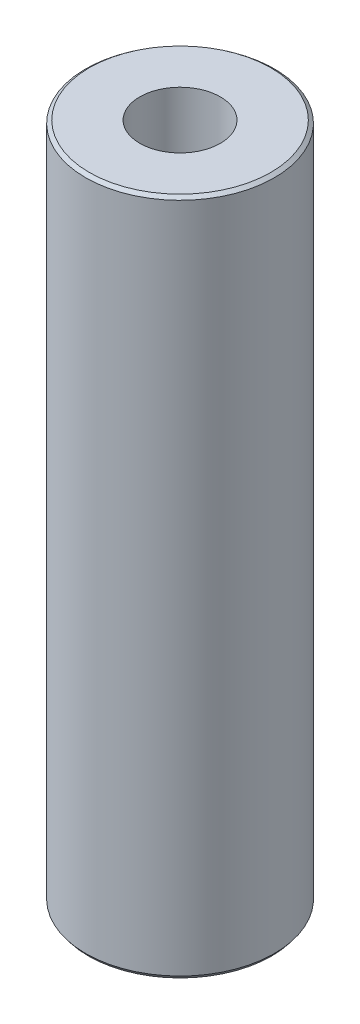
ISO-10303-21;
HEADER;
FILE_DESCRIPTION(('STEP AP214'),'2;1');
FILE_NAME('part.step','',(''),(''),'','','');
FILE_SCHEMA(('AUTOMOTIVE_DESIGN { 1 0 10303 214 1 1 1 1 }'));
ENDSEC;
DATA;
#1=APPLICATION_CONTEXT('core data for automotive mechanical design processes');
#2=APPLICATION_PROTOCOL_DEFINITION('international standard','automotive_design',2000,#1);
#3=PRODUCT_CONTEXT('',#1,'mechanical');
#4=PRODUCT('Part','Part','',(#3));
#5=PRODUCT_RELATED_PRODUCT_CATEGORY('part','',(#4));
#6=PRODUCT_DEFINITION_FORMATION('','',#4);
#7=PRODUCT_DEFINITION_CONTEXT('part definition',#1,'design');
#8=PRODUCT_DEFINITION('design','',#6,#7);
#9=PRODUCT_DEFINITION_SHAPE('','',#8);
#10=(LENGTH_UNIT() NAMED_UNIT(*) SI_UNIT(.MILLI.,.METRE.));
#11=(NAMED_UNIT(*) PLANE_ANGLE_UNIT() SI_UNIT($,.RADIAN.));
#12=(NAMED_UNIT(*) SI_UNIT($,.STERADIAN.) SOLID_ANGLE_UNIT());
#13=UNCERTAINTY_MEASURE_WITH_UNIT(LENGTH_MEASURE(1.E-05),#10,'distance_accuracy_value','');
#14=(GEOMETRIC_REPRESENTATION_CONTEXT(3) GLOBAL_UNCERTAINTY_ASSIGNED_CONTEXT((#13)) GLOBAL_UNIT_ASSIGNED_CONTEXT((#10,
#11,#12)) REPRESENTATION_CONTEXT('',''));
#15=CARTESIAN_POINT('',(0.,0.,0.));
#16=DIRECTION('',(0.,0.,1.));
#17=DIRECTION('',(1.,0.,0.));
#18=AXIS2_PLACEMENT_3D('',#15,#16,#17);
#19=CARTESIAN_POINT('',(0.,179.695013026087,0.));
#20=DIRECTION('',(0.,-1.,0.));
#21=DIRECTION('',(0.,0.,-1.));
#22=AXIS2_PLACEMENT_3D('',#19,#20,#21);
#23=CYLINDRICAL_SURFACE('',#22,25.);
#24=CARTESIAN_POINT('',(0.,178.961587937699,0.));
#25=DIRECTION('',(0.,1.,0.));
#26=DIRECTION('',(0.,0.,1.));
#27=AXIS2_PLACEMENT_3D('',#24,#25,#26);
#28=CIRCLE('',#27,25.);
#29=CARTESIAN_POINT('',(0.,178.961587937699,25.));
#30=VERTEX_POINT('',#29);
#31=EDGE_CURVE('E50',#30,#30,#28,.F.);
#32=ORIENTED_EDGE('',*,*,#31,.T.);
#33=EDGE_LOOP('',(#32));
#34=FACE_BOUND('',#33,.T.);
#35=CARTESIAN_POINT('',(0.,0.959149268777243,0.));
#36=DIRECTION('',(0.,1.,0.));
#37=DIRECTION('',(0.,0.,1.));
#38=AXIS2_PLACEMENT_3D('',#35,#36,#37);
#39=CIRCLE('',#38,25.);
#40=CARTESIAN_POINT('',(0.,0.959149268777243,25.));
#41=VERTEX_POINT('',#40);
#42=EDGE_CURVE('E51',#41,#41,#39,.T.);
#43=ORIENTED_EDGE('',*,*,#42,.T.);
#44=EDGE_LOOP('',(#43));
#45=FACE_BOUND('',#44,.T.);
#46=ADVANCED_FACE('F39',(#34,#45),#23,.T.);
#47=CARTESIAN_POINT('',(0.,179.695013026087,0.));
#48=DIRECTION('',(0.,1.,0.));
#49=DIRECTION('',(0.,0.,1.));
#50=AXIS2_PLACEMENT_3D('',#47,#48,#49);
#51=PLANE('',#50);
#52=CARTESIAN_POINT('',(0.,179.695013026087,0.));
#53=DIRECTION('',(0.,1.,0.));
#54=DIRECTION('',(0.,0.,1.));
#55=AXIS2_PLACEMENT_3D('',#52,#53,#54);
#56=CIRCLE('',#55,24.0408507312228);
#57=CARTESIAN_POINT('',(0.,179.695013026087,24.0408507312228));
#58=VERTEX_POINT('',#57);
#59=EDGE_CURVE('E54',#58,#58,#56,.T.);
#60=ORIENTED_EDGE('',*,*,#59,.T.);
#61=EDGE_LOOP('',(#60));
#62=FACE_BOUND('',#61,.T.);
#63=CARTESIAN_POINT('',(0.,179.695013026087,0.));
#64=DIRECTION('',(0.,1.,0.));
#65=DIRECTION('',(0.,0.,1.));
#66=AXIS2_PLACEMENT_3D('',#63,#64,#65);
#67=CIRCLE('',#66,10.6765974554847);
#68=CARTESIAN_POINT('',(0.,179.695013026087,10.6765974554847));
#69=VERTEX_POINT('',#68);
#70=EDGE_CURVE('E58',#69,#69,#67,.T.);
#71=ORIENTED_EDGE('',*,*,#70,.F.);
#72=EDGE_LOOP('',(#71));
#73=FACE_BOUND('',#72,.T.);
#74=ADVANCED_FACE('F69',(#62,#73),#51,.T.);
#75=CARTESIAN_POINT('',(0.,0.,0.));
#76=DIRECTION('',(0.,1.,0.));
#77=DIRECTION('',(0.,0.,1.));
#78=AXIS2_PLACEMENT_3D('',#75,#76,#77);
#79=PLANE('',#78);
#80=CARTESIAN_POINT('',(0.,0.,0.));
#81=DIRECTION('',(0.,1.,0.));
#82=DIRECTION('',(0.,0.,1.));
#83=AXIS2_PLACEMENT_3D('',#80,#81,#82);
#84=CIRCLE('',#83,24.2665749116122);
#85=CARTESIAN_POINT('',(0.,0.,24.2665749116122));
#86=VERTEX_POINT('',#85);
#87=EDGE_CURVE('E10',#86,#86,#84,.F.);
#88=ORIENTED_EDGE('',*,*,#87,.T.);
#89=EDGE_LOOP('',(#88));
#90=FACE_BOUND('',#89,.T.);
#91=CARTESIAN_POINT('',(0.,0.,0.));
#92=DIRECTION('',(0.,1.,0.));
#93=DIRECTION('',(0.,0.,1.));
#94=AXIS2_PLACEMENT_3D('',#91,#92,#93);
#95=CIRCLE('',#94,10.6765974554847);
#96=CARTESIAN_POINT('',(0.,0.,10.6765974554847));
#97=VERTEX_POINT('',#96);
#98=EDGE_CURVE('E63',#97,#97,#95,.T.);
#99=ORIENTED_EDGE('',*,*,#98,.T.);
#100=EDGE_LOOP('',(#99));
#101=FACE_BOUND('',#100,.T.);
#102=ADVANCED_FACE('F75',(#90,#101),#79,.F.);
#103=CARTESIAN_POINT('',(0.,179.695013026087,0.));
#104=DIRECTION('',(0.,-1.,0.));
#105=DIRECTION('',(0.,0.,-1.));
#106=AXIS2_PLACEMENT_3D('',#103,#104,#105);
#107=CYLINDRICAL_SURFACE('',#106,10.6765974554847);
#108=ORIENTED_EDGE('',*,*,#70,.T.);
#109=EDGE_LOOP('',(#108));
#110=FACE_BOUND('',#109,.T.);
#111=ORIENTED_EDGE('',*,*,#98,.F.);
#112=EDGE_LOOP('',(#111));
#113=FACE_BOUND('',#112,.T.);
#114=ADVANCED_FACE('F70',(#110,#113),#107,.F.);
#115=CARTESIAN_POINT('',(0.,179.695013026087,0.));
#116=DIRECTION('',(0.,-1.,0.));
#117=DIRECTION('',(0.,0.,-1.));
#118=AXIS2_PLACEMENT_3D('',#115,#116,#117);
#119=CONICAL_SURFACE('',#118,24.0408507312228,0.917977326876427);
#120=ORIENTED_EDGE('',*,*,#31,.F.);
#121=EDGE_LOOP('',(#120));
#122=FACE_BOUND('',#121,.T.);
#123=ORIENTED_EDGE('',*,*,#59,.F.);
#124=EDGE_LOOP('',(#123));
#125=FACE_BOUND('',#124,.T.);
#126=ADVANCED_FACE('F81',(#122,#125),#119,.T.);
#127=CARTESIAN_POINT('',(0.,0.959149268777243,0.));
#128=DIRECTION('',(0.,1.,0.));
#129=DIRECTION('',(0.,0.,1.));
#130=AXIS2_PLACEMENT_3D('',#127,#128,#129);
#131=CONICAL_SURFACE('',#130,25.,0.652818999918458);
#132=ORIENTED_EDGE('',*,*,#87,.F.);
#133=EDGE_LOOP('',(#132));
#134=FACE_BOUND('',#133,.T.);
#135=ORIENTED_EDGE('',*,*,#42,.F.);
#136=EDGE_LOOP('',(#135));
#137=FACE_BOUND('',#136,.T.);
#138=ADVANCED_FACE('F45',(#134,#137),#131,.T.);
#139=CLOSED_SHELL('',(#46,#74,#102,#114,#126,#138));
#140=MANIFOLD_SOLID_BREP('B2',#139);
#141=ADVANCED_BREP_SHAPE_REPRESENTATION('',(#18,#140),#14);
#142=SHAPE_DEFINITION_REPRESENTATION(#9,#141);
ENDSEC;
END-ISO-10303-21;
